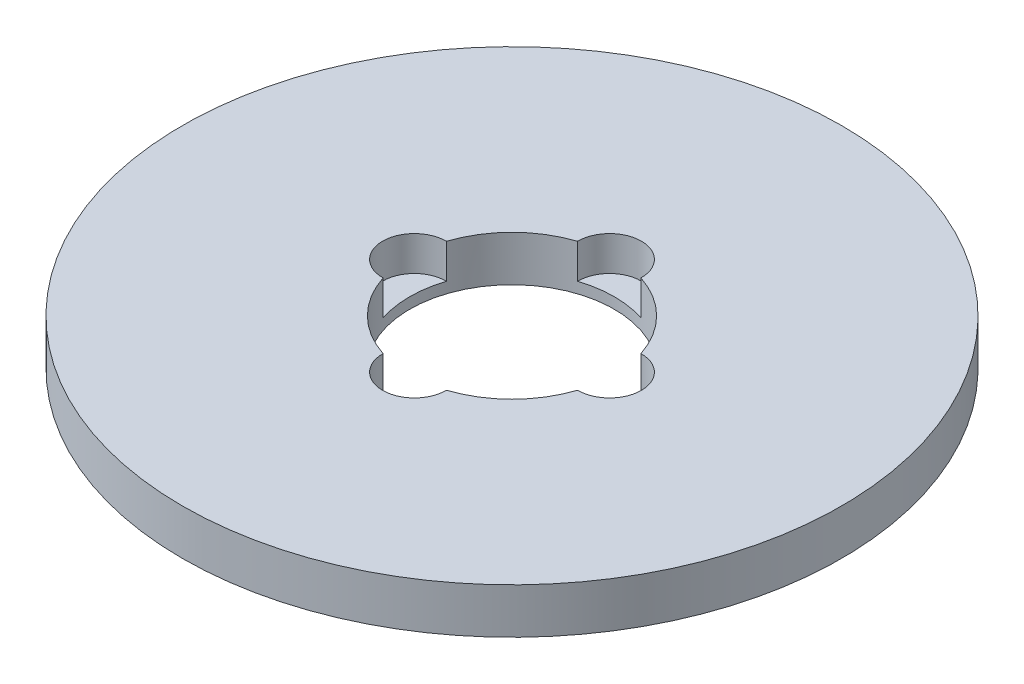
ISO-10303-21;
HEADER;
FILE_DESCRIPTION(('STEP AP214'),'2;1');
FILE_NAME('part.step','',(''),(''),'','','');
FILE_SCHEMA(('AUTOMOTIVE_DESIGN { 1 0 10303 214 1 1 1 1 }'));
ENDSEC;
DATA;
#1=APPLICATION_CONTEXT('core data for automotive mechanical design processes');
#2=APPLICATION_PROTOCOL_DEFINITION('international standard','automotive_design',2000,#1);
#3=PRODUCT_CONTEXT('',#1,'mechanical');
#4=PRODUCT('Part','Part','',(#3));
#5=PRODUCT_RELATED_PRODUCT_CATEGORY('part','',(#4));
#6=PRODUCT_DEFINITION_FORMATION('','',#4);
#7=PRODUCT_DEFINITION_CONTEXT('part definition',#1,'design');
#8=PRODUCT_DEFINITION('design','',#6,#7);
#9=PRODUCT_DEFINITION_SHAPE('','',#8);
#10=(LENGTH_UNIT() NAMED_UNIT(*) SI_UNIT(.MILLI.,.METRE.));
#11=(NAMED_UNIT(*) PLANE_ANGLE_UNIT() SI_UNIT($,.RADIAN.));
#12=(NAMED_UNIT(*) SI_UNIT($,.STERADIAN.) SOLID_ANGLE_UNIT());
#13=UNCERTAINTY_MEASURE_WITH_UNIT(LENGTH_MEASURE(1.E-05),#10,'distance_accuracy_value','');
#14=(GEOMETRIC_REPRESENTATION_CONTEXT(3) GLOBAL_UNCERTAINTY_ASSIGNED_CONTEXT((#13)) GLOBAL_UNIT_ASSIGNED_CONTEXT((#10,
#11,#12)) REPRESENTATION_CONTEXT('',''));
#15=CARTESIAN_POINT('',(0.,0.,0.));
#16=DIRECTION('',(0.,0.,1.));
#17=DIRECTION('',(1.,0.,0.));
#18=AXIS2_PLACEMENT_3D('',#15,#16,#17);
#19=CARTESIAN_POINT('',(0.,10.,0.));
#20=DIRECTION('',(0.,-1.,0.));
#21=DIRECTION('',(0.,0.,-1.));
#22=AXIS2_PLACEMENT_3D('',#19,#20,#21);
#23=CYLINDRICAL_SURFACE('',#22,72.5);
#24=CARTESIAN_POINT('',(0.,10.,0.));
#25=DIRECTION('',(0.,1.,0.));
#26=DIRECTION('',(0.,0.,1.));
#27=AXIS2_PLACEMENT_3D('',#24,#25,#26);
#28=CIRCLE('',#27,72.5);
#29=CARTESIAN_POINT('',(0.,10.,72.5));
#30=VERTEX_POINT('',#29);
#31=EDGE_CURVE('E145',#30,#30,#28,.T.);
#32=ORIENTED_EDGE('',*,*,#31,.F.);
#33=EDGE_LOOP('',(#32));
#34=FACE_BOUND('',#33,.T.);
#35=CARTESIAN_POINT('',(0.,0.,0.));
#36=DIRECTION('',(0.,1.,0.));
#37=DIRECTION('',(0.,0.,1.));
#38=AXIS2_PLACEMENT_3D('',#35,#36,#37);
#39=CIRCLE('',#38,72.5);
#40=CARTESIAN_POINT('',(0.,0.,72.5));
#41=VERTEX_POINT('',#40);
#42=EDGE_CURVE('E143',#41,#41,#39,.T.);
#43=ORIENTED_EDGE('',*,*,#42,.T.);
#44=EDGE_LOOP('',(#43));
#45=FACE_BOUND('',#44,.T.);
#46=ADVANCED_FACE('F39',(#34,#45),#23,.T.);
#47=CARTESIAN_POINT('',(0.,10.,0.));
#48=DIRECTION('',(0.,1.,0.));
#49=DIRECTION('',(0.,0.,1.));
#50=AXIS2_PLACEMENT_3D('',#47,#48,#49);
#51=PLANE('',#50);
#52=CARTESIAN_POINT('',(0.,10.,21.4750981127066));
#53=DIRECTION('',(0.,1.,0.));
#54=DIRECTION('',(1.,0.,0.));
#55=AXIS2_PLACEMENT_3D('',#52,#53,#54);
#56=CIRCLE('',#55,6.97047863902587);
#57=CARTESIAN_POINT('',(-6.96999753563001,10.,21.3932029942529));
#58=VERTEX_POINT('',#57);
#59=CARTESIAN_POINT('',(6.96999753563016,10.,21.3932029942529));
#60=VERTEX_POINT('',#59);
#61=EDGE_CURVE('E152',#58,#60,#56,.T.);
#62=ORIENTED_EDGE('',*,*,#61,.F.);
#63=CARTESIAN_POINT('',(0.,10.,0.));
#64=DIRECTION('',(0.,1.,0.));
#65=DIRECTION('',(0.,0.,1.));
#66=AXIS2_PLACEMENT_3D('',#63,#64,#65);
#67=CIRCLE('',#66,22.5);
#68=CARTESIAN_POINT('',(-21.3932029942529,10.,6.96999753563008));
#69=VERTEX_POINT('',#68);
#70=EDGE_CURVE('E133',#69,#58,#67,.T.);
#71=ORIENTED_EDGE('',*,*,#70,.F.);
#72=CARTESIAN_POINT('',(-21.4750981127066,10.,0.));
#73=DIRECTION('',(0.,1.,0.));
#74=DIRECTION('',(0.,0.,1.));
#75=AXIS2_PLACEMENT_3D('',#72,#73,#74);
#76=CIRCLE('',#75,6.97047863902587);
#77=CARTESIAN_POINT('',(-21.3932029942529,10.,-6.96999753563008));
#78=VERTEX_POINT('',#77);
#79=EDGE_CURVE('E128',#78,#69,#76,.T.);
#80=ORIENTED_EDGE('',*,*,#79,.F.);
#81=CARTESIAN_POINT('',(-6.96999753563031,10.,-21.3932029942528));
#82=VERTEX_POINT('',#81);
#83=EDGE_CURVE('E121',#82,#78,#67,.T.);
#84=ORIENTED_EDGE('',*,*,#83,.F.);
#85=CARTESIAN_POINT('',(-2.24939712931021E-13,10.,-21.4750981127066));
#86=DIRECTION('',(0.,1.,0.));
#87=DIRECTION('',(-1.,0.,0.));
#88=AXIS2_PLACEMENT_3D('',#85,#86,#87);
#89=CIRCLE('',#88,6.97047863902587);
#90=CARTESIAN_POINT('',(6.96999753562986,10.,-21.393202994253));
#91=VERTEX_POINT('',#90);
#92=EDGE_CURVE('E105',#91,#82,#89,.T.);
#93=ORIENTED_EDGE('',*,*,#92,.F.);
#94=CARTESIAN_POINT('',(21.3932029942529,10.,-6.96999753563008));
#95=VERTEX_POINT('',#94);
#96=EDGE_CURVE('E131',#95,#91,#67,.T.);
#97=ORIENTED_EDGE('',*,*,#96,.F.);
#98=CARTESIAN_POINT('',(21.4750981127066,10.,0.));
#99=DIRECTION('',(0.,1.,0.));
#100=DIRECTION('',(0.,0.,-1.));
#101=AXIS2_PLACEMENT_3D('',#98,#99,#100);
#102=CIRCLE('',#101,6.97047863902587);
#103=CARTESIAN_POINT('',(21.3932029942529,10.,6.96999753563008));
#104=VERTEX_POINT('',#103);
#105=EDGE_CURVE('E154',#104,#95,#102,.T.);
#106=ORIENTED_EDGE('',*,*,#105,.F.);
#107=EDGE_CURVE('E134',#60,#104,#67,.T.);
#108=ORIENTED_EDGE('',*,*,#107,.F.);
#109=EDGE_LOOP('',(#62,#71,#80,#84,#93,#97,#106,#108));
#110=FACE_BOUND('',#109,.T.);
#111=ORIENTED_EDGE('',*,*,#31,.T.);
#112=EDGE_LOOP('',(#111));
#113=FACE_BOUND('',#112,.T.);
#114=ADVANCED_FACE('F130',(#110,#113),#51,.T.);
#115=CARTESIAN_POINT('',(0.,0.,0.));
#116=DIRECTION('',(0.,1.,0.));
#117=DIRECTION('',(0.,0.,1.));
#118=AXIS2_PLACEMENT_3D('',#115,#116,#117);
#119=PLANE('',#118);
#120=CARTESIAN_POINT('',(0.,0.,0.));
#121=DIRECTION('',(0.,1.,0.));
#122=DIRECTION('',(0.,0.,1.));
#123=AXIS2_PLACEMENT_3D('',#120,#121,#122);
#124=CIRCLE('',#123,22.5);
#125=CARTESIAN_POINT('',(0.,0.,22.5));
#126=VERTEX_POINT('',#125);
#127=EDGE_CURVE('E135',#126,#126,#124,.T.);
#128=ORIENTED_EDGE('',*,*,#127,.T.);
#129=EDGE_LOOP('',(#128));
#130=FACE_BOUND('',#129,.T.);
#131=ORIENTED_EDGE('',*,*,#42,.F.);
#132=EDGE_LOOP('',(#131));
#133=FACE_BOUND('',#132,.T.);
#134=ADVANCED_FACE('F195',(#130,#133),#119,.F.);
#135=CARTESIAN_POINT('',(0.,10.,0.));
#136=DIRECTION('',(0.,-1.,0.));
#137=DIRECTION('',(0.,0.,-1.));
#138=AXIS2_PLACEMENT_3D('',#135,#136,#137);
#139=CYLINDRICAL_SURFACE('',#138,22.5);
#140=DIRECTION('',(0.,1.,0.));
#141=VECTOR('',#140,1.);
#142=CARTESIAN_POINT('',(-6.96999753563001,6.19417283564291,21.3932029942529));
#143=LINE('',#142,#141);
#144=CARTESIAN_POINT('',(-6.96999753563001,2.38834567128581,21.3932029942529));
#145=VERTEX_POINT('',#144);
#146=EDGE_CURVE('E11',#145,#58,#143,.T.);
#147=ORIENTED_EDGE('',*,*,#146,.F.);
#148=CARTESIAN_POINT('',(0.,2.38834567128581,0.));
#149=DIRECTION('',(0.,1.,0.));
#150=DIRECTION('',(0.,0.,1.));
#151=AXIS2_PLACEMENT_3D('',#148,#149,#150);
#152=CIRCLE('',#151,22.5);
#153=CARTESIAN_POINT('',(6.96999753563016,2.38834567128581,21.3932029942529));
#154=VERTEX_POINT('',#153);
#155=EDGE_CURVE('E169',#145,#154,#152,.T.);
#156=ORIENTED_EDGE('',*,*,#155,.T.);
#157=DIRECTION('',(0.,1.,0.));
#158=VECTOR('',#157,1.);
#159=CARTESIAN_POINT('',(6.96999753563016,6.19417283564291,21.3932029942529));
#160=LINE('',#159,#158);
#161=EDGE_CURVE('E46',#60,#154,#160,.F.);
#162=ORIENTED_EDGE('',*,*,#161,.F.);
#163=ORIENTED_EDGE('',*,*,#107,.T.);
#164=DIRECTION('',(0.,1.,0.));
#165=VECTOR('',#164,1.);
#166=CARTESIAN_POINT('',(21.3932029942529,6.19417283564291,6.96999753563008));
#167=LINE('',#166,#165);
#168=CARTESIAN_POINT('',(21.3932029942529,2.38834567128581,6.96999753563008));
#169=VERTEX_POINT('',#168);
#170=EDGE_CURVE('E151',#169,#104,#167,.T.);
#171=ORIENTED_EDGE('',*,*,#170,.F.);
#172=CARTESIAN_POINT('',(0.,2.38834567128581,0.));
#173=DIRECTION('',(0.,1.,0.));
#174=DIRECTION('',(0.,0.,1.));
#175=AXIS2_PLACEMENT_3D('',#172,#173,#174);
#176=CIRCLE('',#175,22.5);
#177=CARTESIAN_POINT('',(21.3932029942529,2.38834567128581,-6.96999753563008));
#178=VERTEX_POINT('',#177);
#179=EDGE_CURVE('E173',#169,#178,#176,.T.);
#180=ORIENTED_EDGE('',*,*,#179,.T.);
#181=DIRECTION('',(0.,1.,0.));
#182=VECTOR('',#181,1.);
#183=CARTESIAN_POINT('',(21.3932029942529,6.19417283564291,-6.96999753563008));
#184=LINE('',#183,#182);
#185=EDGE_CURVE('E168',#95,#178,#184,.F.);
#186=ORIENTED_EDGE('',*,*,#185,.F.);
#187=ORIENTED_EDGE('',*,*,#96,.T.);
#188=DIRECTION('',(0.,1.,0.));
#189=VECTOR('',#188,1.);
#190=CARTESIAN_POINT('',(6.96999753562986,6.19417283564291,-21.393202994253));
#191=LINE('',#190,#189);
#192=CARTESIAN_POINT('',(6.96999753562986,2.38834567128581,-21.393202994253));
#193=VERTEX_POINT('',#192);
#194=EDGE_CURVE('E108',#193,#91,#191,.T.);
#195=ORIENTED_EDGE('',*,*,#194,.F.);
#196=CARTESIAN_POINT('',(0.,2.38834567128581,0.));
#197=DIRECTION('',(0.,1.,0.));
#198=DIRECTION('',(0.,0.,1.));
#199=AXIS2_PLACEMENT_3D('',#196,#197,#198);
#200=CIRCLE('',#199,22.5);
#201=CARTESIAN_POINT('',(-6.96999753563031,2.38834567128581,-21.3932029942528));
#202=VERTEX_POINT('',#201);
#203=EDGE_CURVE('E122',#193,#202,#200,.T.);
#204=ORIENTED_EDGE('',*,*,#203,.T.);
#205=DIRECTION('',(0.,1.,0.));
#206=VECTOR('',#205,1.);
#207=CARTESIAN_POINT('',(-6.96999753563031,6.19417283564291,-21.3932029942528));
#208=LINE('',#207,#206);
#209=EDGE_CURVE('E106',#82,#202,#208,.F.);
#210=ORIENTED_EDGE('',*,*,#209,.F.);
#211=ORIENTED_EDGE('',*,*,#83,.T.);
#212=DIRECTION('',(0.,1.,0.));
#213=VECTOR('',#212,1.);
#214=CARTESIAN_POINT('',(-21.3932029942529,6.19417283564291,-6.96999753563008));
#215=LINE('',#214,#213);
#216=CARTESIAN_POINT('',(-21.3932029942529,2.38834567128581,-6.96999753563008));
#217=VERTEX_POINT('',#216);
#218=EDGE_CURVE('E177',#217,#78,#215,.T.);
#219=ORIENTED_EDGE('',*,*,#218,.F.);
#220=CARTESIAN_POINT('',(0.,2.38834567128581,0.));
#221=DIRECTION('',(0.,1.,0.));
#222=DIRECTION('',(0.,0.,1.));
#223=AXIS2_PLACEMENT_3D('',#220,#221,#222);
#224=CIRCLE('',#223,22.5);
#225=CARTESIAN_POINT('',(-21.3932029942529,2.38834567128581,6.96999753563008));
#226=VERTEX_POINT('',#225);
#227=EDGE_CURVE('E185',#217,#226,#224,.T.);
#228=ORIENTED_EDGE('',*,*,#227,.T.);
#229=DIRECTION('',(0.,1.,0.));
#230=VECTOR('',#229,1.);
#231=CARTESIAN_POINT('',(-21.3932029942529,6.19417283564291,6.96999753563008));
#232=LINE('',#231,#230);
#233=EDGE_CURVE('E179',#69,#226,#232,.F.);
#234=ORIENTED_EDGE('',*,*,#233,.F.);
#235=ORIENTED_EDGE('',*,*,#70,.T.);
#236=EDGE_LOOP('',(#147,#156,#162,#163,#171,#180,#186,#187,#195,#204,#210,#211,#219,#228,#234,#235));
#237=FACE_BOUND('',#236,.T.);
#238=ORIENTED_EDGE('',*,*,#127,.F.);
#239=EDGE_LOOP('',(#238));
#240=FACE_BOUND('',#239,.T.);
#241=ADVANCED_FACE('F117',(#237,#240),#139,.F.);
#242=CARTESIAN_POINT('',(-21.4750981127066,2.38834567128581,0.));
#243=DIRECTION('',(0.,1.,0.));
#244=DIRECTION('',(0.,0.,1.));
#245=AXIS2_PLACEMENT_3D('',#242,#243,#244);
#246=CYLINDRICAL_SURFACE('',#245,6.97047863902587);
#247=ORIENTED_EDGE('',*,*,#218,.T.);
#248=ORIENTED_EDGE('',*,*,#79,.T.);
#249=ORIENTED_EDGE('',*,*,#233,.T.);
#250=CARTESIAN_POINT('',(-21.4750981127066,2.38834567128581,0.));
#251=DIRECTION('',(0.,1.,0.));
#252=DIRECTION('',(0.,0.,1.));
#253=AXIS2_PLACEMENT_3D('',#250,#251,#252);
#254=CIRCLE('',#253,6.97047863902587);
#255=EDGE_CURVE('E140',#217,#226,#254,.T.);
#256=ORIENTED_EDGE('',*,*,#255,.F.);
#257=EDGE_LOOP('',(#247,#248,#249,#256));
#258=FACE_BOUND('',#257,.T.);
#259=ADVANCED_FACE('F200',(#258),#246,.F.);
#260=CARTESIAN_POINT('',(-21.4750981127066,2.38834567128581,0.));
#261=DIRECTION('',(0.,1.,0.));
#262=DIRECTION('',(0.,0.,1.));
#263=AXIS2_PLACEMENT_3D('',#260,#261,#262);
#264=PLANE('',#263);
#265=ORIENTED_EDGE('',*,*,#255,.T.);
#266=ORIENTED_EDGE('',*,*,#227,.F.);
#267=EDGE_LOOP('',(#265,#266));
#268=FACE_BOUND('',#267,.T.);
#269=ADVANCED_FACE('F202',(#268),#264,.T.);
#270=CARTESIAN_POINT('',(-2.24939712931021E-13,2.38834567128581,-21.4750981127066));
#271=DIRECTION('',(0.,1.,0.));
#272=DIRECTION('',(0.,0.,1.));
#273=AXIS2_PLACEMENT_3D('',#270,#271,#272);
#274=CYLINDRICAL_SURFACE('',#273,6.97047863902587);
#275=ORIENTED_EDGE('',*,*,#194,.T.);
#276=ORIENTED_EDGE('',*,*,#92,.T.);
#277=ORIENTED_EDGE('',*,*,#209,.T.);
#278=CARTESIAN_POINT('',(-2.24939712931021E-13,2.38834567128581,-21.4750981127066));
#279=DIRECTION('',(0.,1.,0.));
#280=DIRECTION('',(-1.,0.,0.));
#281=AXIS2_PLACEMENT_3D('',#278,#279,#280);
#282=CIRCLE('',#281,6.97047863902587);
#283=EDGE_CURVE('E111',#193,#202,#282,.T.);
#284=ORIENTED_EDGE('',*,*,#283,.F.);
#285=EDGE_LOOP('',(#275,#276,#277,#284));
#286=FACE_BOUND('',#285,.T.);
#287=ADVANCED_FACE('F102',(#286),#274,.F.);
#288=CARTESIAN_POINT('',(-2.24939712931021E-13,2.38834567128581,-21.4750981127066));
#289=DIRECTION('',(0.,1.,0.));
#290=DIRECTION('',(-1.,0.,0.));
#291=AXIS2_PLACEMENT_3D('',#288,#289,#290);
#292=PLANE('',#291);
#293=ORIENTED_EDGE('',*,*,#283,.T.);
#294=ORIENTED_EDGE('',*,*,#203,.F.);
#295=EDGE_LOOP('',(#293,#294));
#296=FACE_BOUND('',#295,.T.);
#297=ADVANCED_FACE('F211',(#296),#292,.T.);
#298=CARTESIAN_POINT('',(21.4750981127066,2.38834567128581,0.));
#299=DIRECTION('',(0.,1.,0.));
#300=DIRECTION('',(0.,0.,1.));
#301=AXIS2_PLACEMENT_3D('',#298,#299,#300);
#302=CYLINDRICAL_SURFACE('',#301,6.97047863902587);
#303=ORIENTED_EDGE('',*,*,#170,.T.);
#304=ORIENTED_EDGE('',*,*,#105,.T.);
#305=ORIENTED_EDGE('',*,*,#185,.T.);
#306=CARTESIAN_POINT('',(21.4750981127066,2.38834567128581,0.));
#307=DIRECTION('',(0.,1.,0.));
#308=DIRECTION('',(0.,0.,-1.));
#309=AXIS2_PLACEMENT_3D('',#306,#307,#308);
#310=CIRCLE('',#309,6.97047863902587);
#311=EDGE_CURVE('E56',#169,#178,#310,.T.);
#312=ORIENTED_EDGE('',*,*,#311,.F.);
#313=EDGE_LOOP('',(#303,#304,#305,#312));
#314=FACE_BOUND('',#313,.T.);
#315=ADVANCED_FACE('F212',(#314),#302,.F.);
#316=CARTESIAN_POINT('',(21.4750981127066,2.38834567128581,0.));
#317=DIRECTION('',(0.,1.,0.));
#318=DIRECTION('',(0.,0.,-1.));
#319=AXIS2_PLACEMENT_3D('',#316,#317,#318);
#320=PLANE('',#319);
#321=ORIENTED_EDGE('',*,*,#311,.T.);
#322=ORIENTED_EDGE('',*,*,#179,.F.);
#323=EDGE_LOOP('',(#321,#322));
#324=FACE_BOUND('',#323,.T.);
#325=ADVANCED_FACE('F217',(#324),#320,.T.);
#326=CARTESIAN_POINT('',(0.,2.38834567128581,21.4750981127066));
#327=DIRECTION('',(0.,1.,0.));
#328=DIRECTION('',(0.,0.,1.));
#329=AXIS2_PLACEMENT_3D('',#326,#327,#328);
#330=CYLINDRICAL_SURFACE('',#329,6.97047863902587);
#331=ORIENTED_EDGE('',*,*,#146,.T.);
#332=ORIENTED_EDGE('',*,*,#61,.T.);
#333=ORIENTED_EDGE('',*,*,#161,.T.);
#334=CARTESIAN_POINT('',(0.,2.38834567128581,21.4750981127066));
#335=DIRECTION('',(0.,1.,0.));
#336=DIRECTION('',(1.,0.,0.));
#337=AXIS2_PLACEMENT_3D('',#334,#335,#336);
#338=CIRCLE('',#337,6.97047863902587);
#339=EDGE_CURVE('E55',#145,#154,#338,.T.);
#340=ORIENTED_EDGE('',*,*,#339,.F.);
#341=EDGE_LOOP('',(#331,#332,#333,#340));
#342=FACE_BOUND('',#341,.T.);
#343=ADVANCED_FACE('F170',(#342),#330,.F.);
#344=CARTESIAN_POINT('',(0.,2.38834567128581,21.4750981127066));
#345=DIRECTION('',(0.,1.,0.));
#346=DIRECTION('',(1.,0.,0.));
#347=AXIS2_PLACEMENT_3D('',#344,#345,#346);
#348=PLANE('',#347);
#349=ORIENTED_EDGE('',*,*,#339,.T.);
#350=ORIENTED_EDGE('',*,*,#155,.F.);
#351=EDGE_LOOP('',(#349,#350));
#352=FACE_BOUND('',#351,.T.);
#353=ADVANCED_FACE('F224',(#352),#348,.T.);
#354=CLOSED_SHELL('',(#46,#114,#134,#241,#259,#269,#287,#297,#315,#325,#343,#353));
#355=MANIFOLD_SOLID_BREP('B2',#354);
#356=ADVANCED_BREP_SHAPE_REPRESENTATION('',(#18,#355),#14);
#357=SHAPE_DEFINITION_REPRESENTATION(#9,#356);
ENDSEC;
END-ISO-10303-21;
